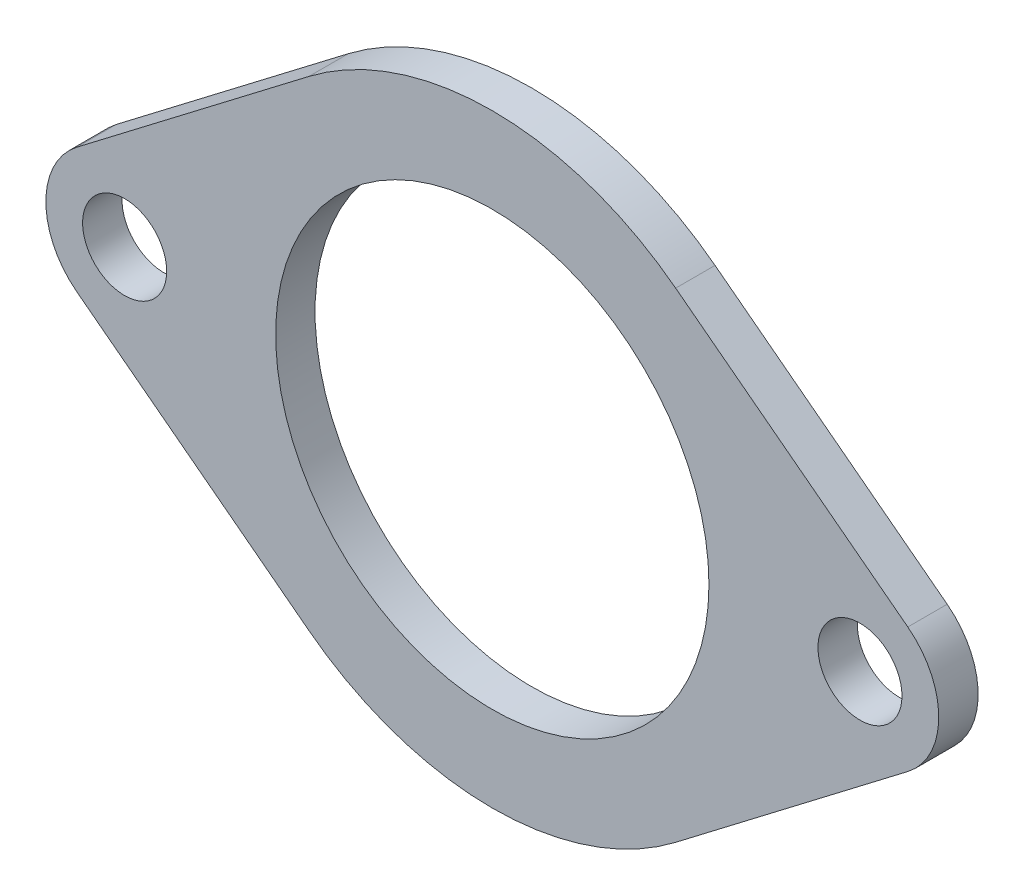
ISO-10303-21;
HEADER;
FILE_DESCRIPTION(('STEP AP214'),'2;1');
FILE_NAME('part.step','',(''),(''),'','','');
FILE_SCHEMA(('AUTOMOTIVE_DESIGN { 1 0 10303 214 1 1 1 1 }'));
ENDSEC;
DATA;
#1=APPLICATION_CONTEXT('core data for automotive mechanical design processes');
#2=APPLICATION_PROTOCOL_DEFINITION('international standard','automotive_design',2000,#1);
#3=PRODUCT_CONTEXT('',#1,'mechanical');
#4=PRODUCT('Part','Part','',(#3));
#5=PRODUCT_RELATED_PRODUCT_CATEGORY('part','',(#4));
#6=PRODUCT_DEFINITION_FORMATION('','',#4);
#7=PRODUCT_DEFINITION_CONTEXT('part definition',#1,'design');
#8=PRODUCT_DEFINITION('design','',#6,#7);
#9=PRODUCT_DEFINITION_SHAPE('','',#8);
#10=(LENGTH_UNIT() NAMED_UNIT(*) SI_UNIT(.MILLI.,.METRE.));
#11=(NAMED_UNIT(*) PLANE_ANGLE_UNIT() SI_UNIT($,.RADIAN.));
#12=(NAMED_UNIT(*) SI_UNIT($,.STERADIAN.) SOLID_ANGLE_UNIT());
#13=UNCERTAINTY_MEASURE_WITH_UNIT(LENGTH_MEASURE(1.E-05),#10,'distance_accuracy_value','');
#14=(GEOMETRIC_REPRESENTATION_CONTEXT(3) GLOBAL_UNCERTAINTY_ASSIGNED_CONTEXT((#13)) GLOBAL_UNIT_ASSIGNED_CONTEXT((#10,
#11,#12)) REPRESENTATION_CONTEXT('',''));
#15=CARTESIAN_POINT('',(0.,0.,0.));
#16=DIRECTION('',(0.,0.,1.));
#17=DIRECTION('',(1.,0.,0.));
#18=AXIS2_PLACEMENT_3D('',#15,#16,#17);
#19=CARTESIAN_POINT('',(-14.,0.,1.5));
#20=DIRECTION('',(0.,0.,-1.));
#21=DIRECTION('',(-1.,0.,0.));
#22=AXIS2_PLACEMENT_3D('',#19,#20,#21);
#23=PLANE('',#22);
#24=CARTESIAN_POINT('',(-14.,0.,1.5));
#25=DIRECTION('',(0.,0.,1.));
#26=DIRECTION('',(-1.,0.,0.));
#27=AXIS2_PLACEMENT_3D('',#24,#25,#26);
#28=CIRCLE('',#27,3.);
#29=CARTESIAN_POINT('',(-15.8214285714286,2.38377808513789,1.5));
#30=VERTEX_POINT('',#29);
#31=CARTESIAN_POINT('',(-15.8214285714286,-2.38377808513789,1.5));
#32=VERTEX_POINT('',#31);
#33=EDGE_CURVE('E151',#30,#32,#28,.T.);
#34=ORIENTED_EDGE('',*,*,#33,.T.);
#35=DIRECTION('',(0.794592695045964,-0.607142857142857,0.));
#36=VECTOR('',#35,1.);
#37=CARTESIAN_POINT('',(-6.98214285714286,-9.13781599302858,1.5));
#38=LINE('',#37,#36);
#39=CARTESIAN_POINT('',(-6.98214285714286,-9.13781599302858,1.5));
#40=VERTEX_POINT('',#39);
#41=EDGE_CURVE('E99',#32,#40,#38,.T.);
#42=ORIENTED_EDGE('',*,*,#41,.T.);
#43=CARTESIAN_POINT('',(0.,0.,1.5));
#44=DIRECTION('',(0.,0.,1.));
#45=DIRECTION('',(1.,0.,0.));
#46=AXIS2_PLACEMENT_3D('',#43,#44,#45);
#47=CIRCLE('',#46,11.5);
#48=CARTESIAN_POINT('',(6.98214285714286,-9.13781599302858,1.5));
#49=VERTEX_POINT('',#48);
#50=EDGE_CURVE('E166',#40,#49,#47,.T.);
#51=ORIENTED_EDGE('',*,*,#50,.T.);
#52=DIRECTION('',(0.794592695045964,0.607142857142857,0.));
#53=VECTOR('',#52,1.);
#54=CARTESIAN_POINT('',(6.98214285714286,-9.13781599302858,1.5));
#55=LINE('',#54,#53);
#56=CARTESIAN_POINT('',(15.8214285714286,-2.38377808513788,1.5));
#57=VERTEX_POINT('',#56);
#58=EDGE_CURVE('E179',#49,#57,#55,.T.);
#59=ORIENTED_EDGE('',*,*,#58,.T.);
#60=CARTESIAN_POINT('',(14.,0.,1.5));
#61=DIRECTION('',(0.,0.,1.));
#62=DIRECTION('',(-1.,0.,0.));
#63=AXIS2_PLACEMENT_3D('',#60,#61,#62);
#64=CIRCLE('',#63,3.);
#65=CARTESIAN_POINT('',(15.8214285714286,2.3837780851379,1.5));
#66=VERTEX_POINT('',#65);
#67=EDGE_CURVE('E118',#57,#66,#64,.T.);
#68=ORIENTED_EDGE('',*,*,#67,.T.);
#69=DIRECTION('',(-0.794592695045964,0.607142857142857,0.));
#70=VECTOR('',#69,1.);
#71=CARTESIAN_POINT('',(6.98214285714285,9.13781599302859,1.5));
#72=LINE('',#71,#70);
#73=CARTESIAN_POINT('',(6.98214285714285,9.13781599302859,1.5));
#74=VERTEX_POINT('',#73);
#75=EDGE_CURVE('E112',#66,#74,#72,.T.);
#76=ORIENTED_EDGE('',*,*,#75,.T.);
#77=CARTESIAN_POINT('',(0.,0.,1.5));
#78=DIRECTION('',(0.,0.,1.));
#79=DIRECTION('',(-1.,0.,0.));
#80=AXIS2_PLACEMENT_3D('',#77,#78,#79);
#81=CIRCLE('',#80,11.5);
#82=CARTESIAN_POINT('',(-6.98214285714285,9.13781599302858,1.5));
#83=VERTEX_POINT('',#82);
#84=EDGE_CURVE('E116',#74,#83,#81,.T.);
#85=ORIENTED_EDGE('',*,*,#84,.T.);
#86=DIRECTION('',(-0.794592695045964,-0.607142857142857,0.));
#87=VECTOR('',#86,1.);
#88=CARTESIAN_POINT('',(-15.8214285714286,2.38377808513789,1.5));
#89=LINE('',#88,#87);
#90=EDGE_CURVE('E56',#83,#30,#89,.T.);
#91=ORIENTED_EDGE('',*,*,#90,.T.);
#92=EDGE_LOOP('',(#34,#42,#51,#59,#68,#76,#85,#91));
#93=FACE_BOUND('',#92,.T.);
#94=CARTESIAN_POINT('',(0.,0.,1.5));
#95=DIRECTION('',(0.,0.,1.));
#96=DIRECTION('',(1.,0.,0.));
#97=AXIS2_PLACEMENT_3D('',#94,#95,#96);
#98=CIRCLE('',#97,8.25);
#99=CARTESIAN_POINT('',(8.25,0.,1.5));
#100=VERTEX_POINT('',#99);
#101=EDGE_CURVE('E140',#100,#100,#98,.T.);
#102=ORIENTED_EDGE('',*,*,#101,.F.);
#103=EDGE_LOOP('',(#102));
#104=FACE_BOUND('',#103,.T.);
#105=CARTESIAN_POINT('',(-14.,0.,1.5));
#106=DIRECTION('',(0.,0.,1.));
#107=DIRECTION('',(1.,0.,0.));
#108=AXIS2_PLACEMENT_3D('',#105,#106,#107);
#109=CIRCLE('',#108,1.6);
#110=CARTESIAN_POINT('',(-12.4,0.,1.5));
#111=VERTEX_POINT('',#110);
#112=EDGE_CURVE('E188',#111,#111,#109,.T.);
#113=ORIENTED_EDGE('',*,*,#112,.F.);
#114=EDGE_LOOP('',(#113));
#115=FACE_BOUND('',#114,.T.);
#116=CARTESIAN_POINT('',(14.,0.,1.5));
#117=DIRECTION('',(0.,0.,1.));
#118=DIRECTION('',(1.,0.,0.));
#119=AXIS2_PLACEMENT_3D('',#116,#117,#118);
#120=CIRCLE('',#119,1.6);
#121=CARTESIAN_POINT('',(15.6,0.,1.5));
#122=VERTEX_POINT('',#121);
#123=EDGE_CURVE('E194',#122,#122,#120,.T.);
#124=ORIENTED_EDGE('',*,*,#123,.F.);
#125=EDGE_LOOP('',(#124));
#126=FACE_BOUND('',#125,.T.);
#127=ADVANCED_FACE('F39',(#93,#104,#115,#126),#23,.F.);
#128=CARTESIAN_POINT('',(-14.,0.,0.));
#129=DIRECTION('',(0.,0.,-1.));
#130=DIRECTION('',(-1.,0.,0.));
#131=AXIS2_PLACEMENT_3D('',#128,#129,#130);
#132=PLANE('',#131);
#133=CARTESIAN_POINT('',(-14.,0.,0.));
#134=DIRECTION('',(0.,0.,1.));
#135=DIRECTION('',(1.,0.,0.));
#136=AXIS2_PLACEMENT_3D('',#133,#134,#135);
#137=CIRCLE('',#136,1.6);
#138=CARTESIAN_POINT('',(-12.4,0.,0.));
#139=VERTEX_POINT('',#138);
#140=EDGE_CURVE('E191',#139,#139,#137,.T.);
#141=ORIENTED_EDGE('',*,*,#140,.T.);
#142=EDGE_LOOP('',(#141));
#143=FACE_BOUND('',#142,.T.);
#144=CARTESIAN_POINT('',(-14.,0.,0.));
#145=DIRECTION('',(0.,0.,1.));
#146=DIRECTION('',(-1.,0.,0.));
#147=AXIS2_PLACEMENT_3D('',#144,#145,#146);
#148=CIRCLE('',#147,3.);
#149=CARTESIAN_POINT('',(-15.8214285714286,2.38377808513789,0.));
#150=VERTEX_POINT('',#149);
#151=CARTESIAN_POINT('',(-15.8214285714286,-2.38377808513789,0.));
#152=VERTEX_POINT('',#151);
#153=EDGE_CURVE('E136',#150,#152,#148,.T.);
#154=ORIENTED_EDGE('',*,*,#153,.F.);
#155=DIRECTION('',(-0.794592695045964,-0.607142857142857,0.));
#156=VECTOR('',#155,1.);
#157=CARTESIAN_POINT('',(-15.8214285714286,2.38377808513789,0.));
#158=LINE('',#157,#156);
#159=CARTESIAN_POINT('',(-6.98214285714285,9.13781599302858,0.));
#160=VERTEX_POINT('',#159);
#161=EDGE_CURVE('E91',#160,#150,#158,.T.);
#162=ORIENTED_EDGE('',*,*,#161,.F.);
#163=CARTESIAN_POINT('',(0.,0.,0.));
#164=DIRECTION('',(0.,0.,1.));
#165=DIRECTION('',(-1.,0.,0.));
#166=AXIS2_PLACEMENT_3D('',#163,#164,#165);
#167=CIRCLE('',#166,11.5);
#168=CARTESIAN_POINT('',(6.98214285714285,9.13781599302859,0.));
#169=VERTEX_POINT('',#168);
#170=EDGE_CURVE('E85',#169,#160,#167,.T.);
#171=ORIENTED_EDGE('',*,*,#170,.F.);
#172=DIRECTION('',(-0.794592695045964,0.607142857142857,0.));
#173=VECTOR('',#172,1.);
#174=CARTESIAN_POINT('',(6.98214285714285,9.13781599302859,0.));
#175=LINE('',#174,#173);
#176=CARTESIAN_POINT('',(15.8214285714286,2.3837780851379,0.));
#177=VERTEX_POINT('',#176);
#178=EDGE_CURVE('E126',#177,#169,#175,.T.);
#179=ORIENTED_EDGE('',*,*,#178,.F.);
#180=CARTESIAN_POINT('',(14.,0.,0.));
#181=DIRECTION('',(0.,0.,1.));
#182=DIRECTION('',(-1.,0.,0.));
#183=AXIS2_PLACEMENT_3D('',#180,#181,#182);
#184=CIRCLE('',#183,3.);
#185=CARTESIAN_POINT('',(15.8214285714286,-2.38377808513788,0.));
#186=VERTEX_POINT('',#185);
#187=EDGE_CURVE('E146',#186,#177,#184,.T.);
#188=ORIENTED_EDGE('',*,*,#187,.F.);
#189=DIRECTION('',(0.794592695045964,0.607142857142857,0.));
#190=VECTOR('',#189,1.);
#191=CARTESIAN_POINT('',(6.98214285714286,-9.13781599302858,0.));
#192=LINE('',#191,#190);
#193=CARTESIAN_POINT('',(6.98214285714286,-9.13781599302858,0.));
#194=VERTEX_POINT('',#193);
#195=EDGE_CURVE('E144',#194,#186,#192,.T.);
#196=ORIENTED_EDGE('',*,*,#195,.F.);
#197=CARTESIAN_POINT('',(0.,0.,0.));
#198=DIRECTION('',(0.,0.,1.));
#199=DIRECTION('',(1.,0.,0.));
#200=AXIS2_PLACEMENT_3D('',#197,#198,#199);
#201=CIRCLE('',#200,11.5);
#202=CARTESIAN_POINT('',(-6.98214285714286,-9.13781599302858,0.));
#203=VERTEX_POINT('',#202);
#204=EDGE_CURVE('E142',#203,#194,#201,.T.);
#205=ORIENTED_EDGE('',*,*,#204,.F.);
#206=DIRECTION('',(0.794592695045964,-0.607142857142857,0.));
#207=VECTOR('',#206,1.);
#208=CARTESIAN_POINT('',(-6.98214285714286,-9.13781599302858,0.));
#209=LINE('',#208,#207);
#210=EDGE_CURVE('E139',#152,#203,#209,.T.);
#211=ORIENTED_EDGE('',*,*,#210,.F.);
#212=EDGE_LOOP('',(#154,#162,#171,#179,#188,#196,#205,#211));
#213=FACE_BOUND('',#212,.T.);
#214=CARTESIAN_POINT('',(0.,0.,0.));
#215=DIRECTION('',(0.,0.,1.));
#216=DIRECTION('',(1.,0.,0.));
#217=AXIS2_PLACEMENT_3D('',#214,#215,#216);
#218=CIRCLE('',#217,8.25);
#219=CARTESIAN_POINT('',(8.25,0.,0.));
#220=VERTEX_POINT('',#219);
#221=EDGE_CURVE('E185',#220,#220,#218,.T.);
#222=ORIENTED_EDGE('',*,*,#221,.T.);
#223=EDGE_LOOP('',(#222));
#224=FACE_BOUND('',#223,.T.);
#225=CARTESIAN_POINT('',(14.,0.,0.));
#226=DIRECTION('',(0.,0.,1.));
#227=DIRECTION('',(1.,0.,0.));
#228=AXIS2_PLACEMENT_3D('',#225,#226,#227);
#229=CIRCLE('',#228,1.6);
#230=CARTESIAN_POINT('',(15.6,0.,0.));
#231=VERTEX_POINT('',#230);
#232=EDGE_CURVE('E197',#231,#231,#229,.T.);
#233=ORIENTED_EDGE('',*,*,#232,.T.);
#234=EDGE_LOOP('',(#233));
#235=FACE_BOUND('',#234,.T.);
#236=ADVANCED_FACE('F170',(#143,#213,#224,#235),#132,.T.);
#237=CARTESIAN_POINT('',(-14.,0.,1.5));
#238=DIRECTION('',(0.,0.,-1.));
#239=DIRECTION('',(-1.,0.,0.));
#240=AXIS2_PLACEMENT_3D('',#237,#238,#239);
#241=CYLINDRICAL_SURFACE('',#240,3.);
#242=ORIENTED_EDGE('',*,*,#153,.T.);
#243=DIRECTION('',(0.,0.,-1.));
#244=VECTOR('',#243,1.);
#245=CARTESIAN_POINT('',(-15.8214285714286,-2.38377808513789,1.5));
#246=LINE('',#245,#244);
#247=EDGE_CURVE('E11',#32,#152,#246,.T.);
#248=ORIENTED_EDGE('',*,*,#247,.F.);
#249=ORIENTED_EDGE('',*,*,#33,.F.);
#250=DIRECTION('',(0.,0.,-1.));
#251=VECTOR('',#250,1.);
#252=CARTESIAN_POINT('',(-15.8214285714286,2.38377808513789,1.5));
#253=LINE('',#252,#251);
#254=EDGE_CURVE('E132',#30,#150,#253,.T.);
#255=ORIENTED_EDGE('',*,*,#254,.T.);
#256=EDGE_LOOP('',(#242,#248,#249,#255));
#257=FACE_BOUND('',#256,.T.);
#258=ADVANCED_FACE('F41',(#257),#241,.T.);
#259=CARTESIAN_POINT('',(-6.98214285714286,-9.13781599302858,1.5));
#260=DIRECTION('',(0.607142857142857,0.794592695045964,0.));
#261=DIRECTION('',(-0.794592695045964,0.607142857142857,0.));
#262=AXIS2_PLACEMENT_3D('',#259,#260,#261);
#263=PLANE('',#262);
#264=ORIENTED_EDGE('',*,*,#210,.T.);
#265=DIRECTION('',(0.,0.,-1.));
#266=VECTOR('',#265,1.);
#267=CARTESIAN_POINT('',(-6.98214285714286,-9.13781599302858,1.5));
#268=LINE('',#267,#266);
#269=EDGE_CURVE('E48',#40,#203,#268,.T.);
#270=ORIENTED_EDGE('',*,*,#269,.F.);
#271=ORIENTED_EDGE('',*,*,#41,.F.);
#272=ORIENTED_EDGE('',*,*,#247,.T.);
#273=EDGE_LOOP('',(#264,#270,#271,#272));
#274=FACE_BOUND('',#273,.T.);
#275=ADVANCED_FACE('F229',(#274),#263,.F.);
#276=CARTESIAN_POINT('',(0.,0.,1.5));
#277=DIRECTION('',(0.,0.,-1.));
#278=DIRECTION('',(-1.,0.,0.));
#279=AXIS2_PLACEMENT_3D('',#276,#277,#278);
#280=CYLINDRICAL_SURFACE('',#279,11.5);
#281=ORIENTED_EDGE('',*,*,#204,.T.);
#282=DIRECTION('',(0.,0.,-1.));
#283=VECTOR('',#282,1.);
#284=CARTESIAN_POINT('',(6.98214285714286,-9.13781599302858,1.5));
#285=LINE('',#284,#283);
#286=EDGE_CURVE('E158',#49,#194,#285,.T.);
#287=ORIENTED_EDGE('',*,*,#286,.F.);
#288=ORIENTED_EDGE('',*,*,#50,.F.);
#289=ORIENTED_EDGE('',*,*,#269,.T.);
#290=EDGE_LOOP('',(#281,#287,#288,#289));
#291=FACE_BOUND('',#290,.T.);
#292=ADVANCED_FACE('F164',(#291),#280,.T.);
#293=CARTESIAN_POINT('',(6.98214285714286,-9.13781599302858,1.5));
#294=DIRECTION('',(-0.607142857142857,0.794592695045964,0.));
#295=DIRECTION('',(-0.794592695045964,-0.607142857142857,0.));
#296=AXIS2_PLACEMENT_3D('',#293,#294,#295);
#297=PLANE('',#296);
#298=ORIENTED_EDGE('',*,*,#195,.T.);
#299=DIRECTION('',(0.,0.,-1.));
#300=VECTOR('',#299,1.);
#301=CARTESIAN_POINT('',(15.8214285714286,-2.38377808513788,1.5));
#302=LINE('',#301,#300);
#303=EDGE_CURVE('E155',#57,#186,#302,.T.);
#304=ORIENTED_EDGE('',*,*,#303,.F.);
#305=ORIENTED_EDGE('',*,*,#58,.F.);
#306=ORIENTED_EDGE('',*,*,#286,.T.);
#307=EDGE_LOOP('',(#298,#304,#305,#306));
#308=FACE_BOUND('',#307,.T.);
#309=ADVANCED_FACE('F175',(#308),#297,.F.);
#310=CARTESIAN_POINT('',(14.,0.,1.5));
#311=DIRECTION('',(0.,0.,-1.));
#312=DIRECTION('',(-1.,0.,0.));
#313=AXIS2_PLACEMENT_3D('',#310,#311,#312);
#314=CYLINDRICAL_SURFACE('',#313,3.);
#315=ORIENTED_EDGE('',*,*,#187,.T.);
#316=DIRECTION('',(0.,0.,-1.));
#317=VECTOR('',#316,1.);
#318=CARTESIAN_POINT('',(15.8214285714286,2.3837780851379,1.5));
#319=LINE('',#318,#317);
#320=EDGE_CURVE('E127',#66,#177,#319,.T.);
#321=ORIENTED_EDGE('',*,*,#320,.F.);
#322=ORIENTED_EDGE('',*,*,#67,.F.);
#323=ORIENTED_EDGE('',*,*,#303,.T.);
#324=EDGE_LOOP('',(#315,#321,#322,#323));
#325=FACE_BOUND('',#324,.T.);
#326=ADVANCED_FACE('F178',(#325),#314,.T.);
#327=CARTESIAN_POINT('',(6.98214285714285,9.13781599302859,1.5));
#328=DIRECTION('',(-0.607142857142857,-0.794592695045964,0.));
#329=DIRECTION('',(0.794592695045964,-0.607142857142857,0.));
#330=AXIS2_PLACEMENT_3D('',#327,#328,#329);
#331=PLANE('',#330);
#332=ORIENTED_EDGE('',*,*,#178,.T.);
#333=DIRECTION('',(0.,0.,-1.));
#334=VECTOR('',#333,1.);
#335=CARTESIAN_POINT('',(6.98214285714285,9.13781599302859,1.5));
#336=LINE('',#335,#334);
#337=EDGE_CURVE('E123',#74,#169,#336,.T.);
#338=ORIENTED_EDGE('',*,*,#337,.F.);
#339=ORIENTED_EDGE('',*,*,#75,.F.);
#340=ORIENTED_EDGE('',*,*,#320,.T.);
#341=EDGE_LOOP('',(#332,#338,#339,#340));
#342=FACE_BOUND('',#341,.T.);
#343=ADVANCED_FACE('F124',(#342),#331,.F.);
#344=CARTESIAN_POINT('',(0.,0.,1.5));
#345=DIRECTION('',(0.,0.,-1.));
#346=DIRECTION('',(-1.,0.,0.));
#347=AXIS2_PLACEMENT_3D('',#344,#345,#346);
#348=CYLINDRICAL_SURFACE('',#347,11.5);
#349=ORIENTED_EDGE('',*,*,#170,.T.);
#350=DIRECTION('',(0.,0.,-1.));
#351=VECTOR('',#350,1.);
#352=CARTESIAN_POINT('',(-6.98214285714285,9.13781599302858,1.5));
#353=LINE('',#352,#351);
#354=EDGE_CURVE('E128',#83,#160,#353,.T.);
#355=ORIENTED_EDGE('',*,*,#354,.F.);
#356=ORIENTED_EDGE('',*,*,#84,.F.);
#357=ORIENTED_EDGE('',*,*,#337,.T.);
#358=EDGE_LOOP('',(#349,#355,#356,#357));
#359=FACE_BOUND('',#358,.T.);
#360=ADVANCED_FACE('F130',(#359),#348,.T.);
#361=CARTESIAN_POINT('',(-15.8214285714286,2.38377808513789,1.5));
#362=DIRECTION('',(0.607142857142857,-0.794592695045964,0.));
#363=DIRECTION('',(0.794592695045964,0.607142857142857,0.));
#364=AXIS2_PLACEMENT_3D('',#361,#362,#363);
#365=PLANE('',#364);
#366=ORIENTED_EDGE('',*,*,#161,.T.);
#367=ORIENTED_EDGE('',*,*,#254,.F.);
#368=ORIENTED_EDGE('',*,*,#90,.F.);
#369=ORIENTED_EDGE('',*,*,#354,.T.);
#370=EDGE_LOOP('',(#366,#367,#368,#369));
#371=FACE_BOUND('',#370,.T.);
#372=ADVANCED_FACE('F217',(#371),#365,.F.);
#373=CARTESIAN_POINT('',(0.,0.,1.5));
#374=DIRECTION('',(0.,0.,-1.));
#375=DIRECTION('',(-1.,0.,0.));
#376=AXIS2_PLACEMENT_3D('',#373,#374,#375);
#377=CYLINDRICAL_SURFACE('',#376,8.25);
#378=ORIENTED_EDGE('',*,*,#101,.T.);
#379=EDGE_LOOP('',(#378));
#380=FACE_BOUND('',#379,.T.);
#381=ORIENTED_EDGE('',*,*,#221,.F.);
#382=EDGE_LOOP('',(#381));
#383=FACE_BOUND('',#382,.T.);
#384=ADVANCED_FACE('F214',(#380,#383),#377,.F.);
#385=CARTESIAN_POINT('',(-14.,0.,1.5));
#386=DIRECTION('',(0.,0.,-1.));
#387=DIRECTION('',(-1.,0.,0.));
#388=AXIS2_PLACEMENT_3D('',#385,#386,#387);
#389=CYLINDRICAL_SURFACE('',#388,1.6);
#390=ORIENTED_EDGE('',*,*,#112,.T.);
#391=EDGE_LOOP('',(#390));
#392=FACE_BOUND('',#391,.T.);
#393=ORIENTED_EDGE('',*,*,#140,.F.);
#394=EDGE_LOOP('',(#393));
#395=FACE_BOUND('',#394,.T.);
#396=ADVANCED_FACE('F292',(#392,#395),#389,.F.);
#397=CARTESIAN_POINT('',(14.,0.,1.5));
#398=DIRECTION('',(0.,0.,-1.));
#399=DIRECTION('',(-1.,0.,0.));
#400=AXIS2_PLACEMENT_3D('',#397,#398,#399);
#401=CYLINDRICAL_SURFACE('',#400,1.6);
#402=ORIENTED_EDGE('',*,*,#123,.T.);
#403=EDGE_LOOP('',(#402));
#404=FACE_BOUND('',#403,.T.);
#405=ORIENTED_EDGE('',*,*,#232,.F.);
#406=EDGE_LOOP('',(#405));
#407=FACE_BOUND('',#406,.T.);
#408=ADVANCED_FACE('F203',(#404,#407),#401,.F.);
#409=CLOSED_SHELL('',(#127,#236,#258,#275,#292,#309,#326,#343,#360,#372,#384,#396,#408));
#410=MANIFOLD_SOLID_BREP('B2',#409);
#411=ADVANCED_BREP_SHAPE_REPRESENTATION('',(#18,#410),#14);
#412=SHAPE_DEFINITION_REPRESENTATION(#9,#411);
ENDSEC;
END-ISO-10303-21;
